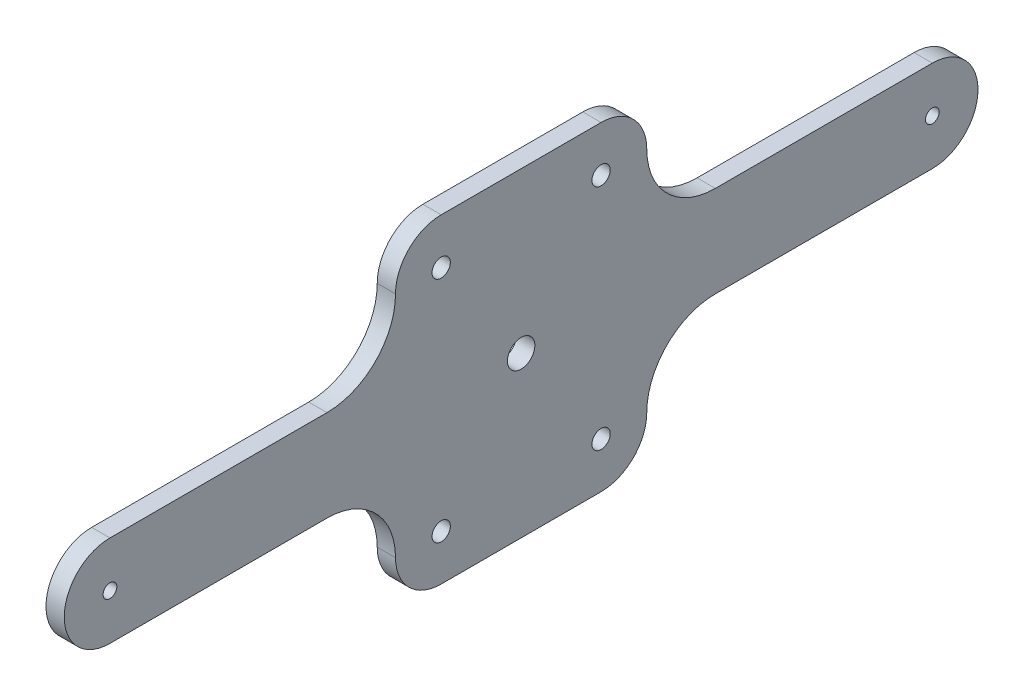
ISO-10303-21;
HEADER;
FILE_DESCRIPTION(('STEP AP214'),'2;1');
FILE_NAME('part.step','',(''),(''),'','','');
FILE_SCHEMA(('AUTOMOTIVE_DESIGN { 1 0 10303 214 1 1 1 1 }'));
ENDSEC;
DATA;
#1=APPLICATION_CONTEXT('core data for automotive mechanical design processes');
#2=APPLICATION_PROTOCOL_DEFINITION('international standard','automotive_design',2000,#1);
#3=PRODUCT_CONTEXT('',#1,'mechanical');
#4=PRODUCT('Part','Part','',(#3));
#5=PRODUCT_RELATED_PRODUCT_CATEGORY('part','',(#4));
#6=PRODUCT_DEFINITION_FORMATION('','',#4);
#7=PRODUCT_DEFINITION_CONTEXT('part definition',#1,'design');
#8=PRODUCT_DEFINITION('design','',#6,#7);
#9=PRODUCT_DEFINITION_SHAPE('','',#8);
#10=(LENGTH_UNIT() NAMED_UNIT(*) SI_UNIT(.MILLI.,.METRE.));
#11=(NAMED_UNIT(*) PLANE_ANGLE_UNIT() SI_UNIT($,.RADIAN.));
#12=(NAMED_UNIT(*) SI_UNIT($,.STERADIAN.) SOLID_ANGLE_UNIT());
#13=UNCERTAINTY_MEASURE_WITH_UNIT(LENGTH_MEASURE(1.E-05),#10,'distance_accuracy_value','');
#14=(GEOMETRIC_REPRESENTATION_CONTEXT(3) GLOBAL_UNCERTAINTY_ASSIGNED_CONTEXT((#13)) GLOBAL_UNIT_ASSIGNED_CONTEXT((#10,
#11,#12)) REPRESENTATION_CONTEXT('',''));
#15=CARTESIAN_POINT('',(0.,0.,0.));
#16=DIRECTION('',(0.,0.,1.));
#17=DIRECTION('',(1.,0.,0.));
#18=AXIS2_PLACEMENT_3D('',#15,#16,#17);
#19=CARTESIAN_POINT('',(4.,0.,0.));
#20=DIRECTION('',(1.,0.,0.));
#21=DIRECTION('',(0.,0.,-1.));
#22=AXIS2_PLACEMENT_3D('',#19,#20,#21);
#23=PLANE('',#22);
#24=CARTESIAN_POINT('',(4.,0.,0.));
#25=DIRECTION('',(1.,0.,0.));
#26=DIRECTION('',(0.,0.,-1.));
#27=AXIS2_PLACEMENT_3D('',#24,#25,#26);
#28=CIRCLE('',#27,3.);
#29=CARTESIAN_POINT('',(4.,0.,-3.));
#30=VERTEX_POINT('',#29);
#31=EDGE_CURVE('E188',#30,#30,#28,.T.);
#32=ORIENTED_EDGE('',*,*,#31,.F.);
#33=EDGE_LOOP('',(#32));
#34=FACE_BOUND('',#33,.T.);
#35=CARTESIAN_POINT('',(4.,25.,17.5));
#36=DIRECTION('',(1.,0.,0.));
#37=DIRECTION('',(0.,0.,-1.));
#38=AXIS2_PLACEMENT_3D('',#35,#36,#37);
#39=CIRCLE('',#38,2.);
#40=CARTESIAN_POINT('',(4.,25.,15.5));
#41=VERTEX_POINT('',#40);
#42=EDGE_CURVE('E305',#41,#41,#39,.T.);
#43=ORIENTED_EDGE('',*,*,#42,.F.);
#44=EDGE_LOOP('',(#43));
#45=FACE_BOUND('',#44,.T.);
#46=CARTESIAN_POINT('',(4.,0.,90.));
#47=DIRECTION('',(1.,0.,0.));
#48=DIRECTION('',(0.,0.,-1.));
#49=AXIS2_PLACEMENT_3D('',#46,#47,#48);
#50=CIRCLE('',#49,1.5);
#51=CARTESIAN_POINT('',(4.,0.,88.5));
#52=VERTEX_POINT('',#51);
#53=EDGE_CURVE('E41',#52,#52,#50,.T.);
#54=ORIENTED_EDGE('',*,*,#53,.F.);
#55=EDGE_LOOP('',(#54));
#56=FACE_BOUND('',#55,.T.);
#57=CARTESIAN_POINT('',(4.,-25.,17.5));
#58=DIRECTION('',(-1.,0.,0.));
#59=DIRECTION('',(0.,0.,-1.));
#60=AXIS2_PLACEMENT_3D('',#57,#58,#59);
#61=CIRCLE('',#60,2.);
#62=CARTESIAN_POINT('',(4.,-25.,15.5));
#63=VERTEX_POINT('',#62);
#64=EDGE_CURVE('E268',#63,#63,#61,.T.);
#65=ORIENTED_EDGE('',*,*,#64,.T.);
#66=EDGE_LOOP('',(#65));
#67=FACE_BOUND('',#66,.T.);
#68=CARTESIAN_POINT('',(4.,0.,-90.));
#69=DIRECTION('',(-1.,0.,0.));
#70=DIRECTION('',(0.,0.,1.));
#71=AXIS2_PLACEMENT_3D('',#68,#69,#70);
#72=CIRCLE('',#71,1.5);
#73=CARTESIAN_POINT('',(4.,0.,-88.5));
#74=VERTEX_POINT('',#73);
#75=EDGE_CURVE('E237',#74,#74,#72,.T.);
#76=ORIENTED_EDGE('',*,*,#75,.T.);
#77=EDGE_LOOP('',(#76));
#78=FACE_BOUND('',#77,.T.);
#79=CARTESIAN_POINT('',(4.,25.,-17.5));
#80=DIRECTION('',(-1.,0.,0.));
#81=DIRECTION('',(0.,0.,1.));
#82=AXIS2_PLACEMENT_3D('',#79,#80,#81);
#83=CIRCLE('',#82,2.);
#84=CARTESIAN_POINT('',(4.,25.,-15.5));
#85=VERTEX_POINT('',#84);
#86=EDGE_CURVE('E227',#85,#85,#83,.T.);
#87=ORIENTED_EDGE('',*,*,#86,.T.);
#88=EDGE_LOOP('',(#87));
#89=FACE_BOUND('',#88,.T.);
#90=CARTESIAN_POINT('',(4.,-25.,-17.5));
#91=DIRECTION('',(1.,0.,0.));
#92=DIRECTION('',(0.,0.,1.));
#93=AXIS2_PLACEMENT_3D('',#90,#91,#92);
#94=CIRCLE('',#93,2.);
#95=CARTESIAN_POINT('',(4.,-25.,-15.5));
#96=VERTEX_POINT('',#95);
#97=EDGE_CURVE('E200',#96,#96,#94,.T.);
#98=ORIENTED_EDGE('',*,*,#97,.F.);
#99=EDGE_LOOP('',(#98));
#100=FACE_BOUND('',#99,.T.);
#101=DIRECTION('',(0.,0.,-1.));
#102=VECTOR('',#101,1.);
#103=CARTESIAN_POINT('',(4.,-35.,17.5));
#104=LINE('',#103,#102);
#105=CARTESIAN_POINT('',(4.,-35.,17.5));
#106=VERTEX_POINT('',#105);
#107=CARTESIAN_POINT('',(4.,-35.,-17.5));
#108=VERTEX_POINT('',#107);
#109=EDGE_CURVE('E243',#106,#108,#104,.T.);
#110=ORIENTED_EDGE('',*,*,#109,.T.);
#111=CARTESIAN_POINT('',(4.,-25.,-17.5));
#112=DIRECTION('',(-1.,0.,0.));
#113=DIRECTION('',(0.,0.,1.));
#114=AXIS2_PLACEMENT_3D('',#111,#112,#113);
#115=CIRCLE('',#114,10.);
#116=CARTESIAN_POINT('',(4.,-25.,-27.5));
#117=VERTEX_POINT('',#116);
#118=EDGE_CURVE('E181',#117,#108,#115,.T.);
#119=ORIENTED_EDGE('',*,*,#118,.F.);
#120=CARTESIAN_POINT('',(4.,-25.,-42.5));
#121=DIRECTION('',(1.,0.,0.));
#122=DIRECTION('',(0.,0.,1.));
#123=AXIS2_PLACEMENT_3D('',#120,#121,#122);
#124=CIRCLE('',#123,15.);
#125=CARTESIAN_POINT('',(4.,-10.,-42.5));
#126=VERTEX_POINT('',#125);
#127=EDGE_CURVE('E185',#126,#117,#124,.T.);
#128=ORIENTED_EDGE('',*,*,#127,.F.);
#129=DIRECTION('',(0.,0.,1.));
#130=VECTOR('',#129,1.);
#131=CARTESIAN_POINT('',(4.,-10.,-90.));
#132=LINE('',#131,#130);
#133=CARTESIAN_POINT('',(4.,-10.,-90.));
#134=VERTEX_POINT('',#133);
#135=EDGE_CURVE('E192',#134,#126,#132,.T.);
#136=ORIENTED_EDGE('',*,*,#135,.F.);
#137=CARTESIAN_POINT('',(4.,0.,-90.));
#138=DIRECTION('',(1.,0.,0.));
#139=DIRECTION('',(0.,0.,1.));
#140=AXIS2_PLACEMENT_3D('',#137,#138,#139);
#141=CIRCLE('',#140,10.);
#142=CARTESIAN_POINT('',(4.,10.,-90.));
#143=VERTEX_POINT('',#142);
#144=EDGE_CURVE('E171',#134,#143,#141,.T.);
#145=ORIENTED_EDGE('',*,*,#144,.T.);
#146=DIRECTION('',(0.,0.,1.));
#147=VECTOR('',#146,1.);
#148=CARTESIAN_POINT('',(4.,10.,-90.));
#149=LINE('',#148,#147);
#150=CARTESIAN_POINT('',(4.,10.,-42.5));
#151=VERTEX_POINT('',#150);
#152=EDGE_CURVE('E221',#143,#151,#149,.T.);
#153=ORIENTED_EDGE('',*,*,#152,.T.);
#154=CARTESIAN_POINT('',(4.,25.,-42.5));
#155=DIRECTION('',(-1.,0.,0.));
#156=DIRECTION('',(0.,0.,1.));
#157=AXIS2_PLACEMENT_3D('',#154,#155,#156);
#158=CIRCLE('',#157,15.);
#159=CARTESIAN_POINT('',(4.,25.,-27.5));
#160=VERTEX_POINT('',#159);
#161=EDGE_CURVE('E218',#151,#160,#158,.T.);
#162=ORIENTED_EDGE('',*,*,#161,.T.);
#163=CARTESIAN_POINT('',(4.,25.,-17.5));
#164=DIRECTION('',(1.,0.,0.));
#165=DIRECTION('',(0.,0.,1.));
#166=AXIS2_PLACEMENT_3D('',#163,#164,#165);
#167=CIRCLE('',#166,10.);
#168=CARTESIAN_POINT('',(4.,35.,-17.5));
#169=VERTEX_POINT('',#168);
#170=EDGE_CURVE('E207',#160,#169,#167,.T.);
#171=ORIENTED_EDGE('',*,*,#170,.T.);
#172=DIRECTION('',(0.,0.,-1.));
#173=VECTOR('',#172,1.);
#174=CARTESIAN_POINT('',(4.,35.,17.5));
#175=LINE('',#174,#173);
#176=CARTESIAN_POINT('',(4.,35.,17.5));
#177=VERTEX_POINT('',#176);
#178=EDGE_CURVE('E283',#177,#169,#175,.T.);
#179=ORIENTED_EDGE('',*,*,#178,.F.);
#180=CARTESIAN_POINT('',(4.,25.,17.5));
#181=DIRECTION('',(-1.,0.,0.));
#182=DIRECTION('',(0.,0.,-1.));
#183=AXIS2_PLACEMENT_3D('',#180,#181,#182);
#184=CIRCLE('',#183,10.);
#185=CARTESIAN_POINT('',(4.,25.,27.5));
#186=VERTEX_POINT('',#185);
#187=EDGE_CURVE('E301',#186,#177,#184,.T.);
#188=ORIENTED_EDGE('',*,*,#187,.F.);
#189=CARTESIAN_POINT('',(4.,25.,42.5));
#190=DIRECTION('',(1.,0.,0.));
#191=DIRECTION('',(0.,0.,-1.));
#192=AXIS2_PLACEMENT_3D('',#189,#190,#191);
#193=CIRCLE('',#192,15.);
#194=CARTESIAN_POINT('',(4.,10.,42.5));
#195=VERTEX_POINT('',#194);
#196=EDGE_CURVE('E298',#195,#186,#193,.T.);
#197=ORIENTED_EDGE('',*,*,#196,.F.);
#198=DIRECTION('',(0.,0.,-1.));
#199=VECTOR('',#198,1.);
#200=CARTESIAN_POINT('',(4.,10.,90.));
#201=LINE('',#200,#199);
#202=CARTESIAN_POINT('',(4.,10.,90.));
#203=VERTEX_POINT('',#202);
#204=EDGE_CURVE('E296',#203,#195,#201,.T.);
#205=ORIENTED_EDGE('',*,*,#204,.F.);
#206=CARTESIAN_POINT('',(4.,0.,90.));
#207=DIRECTION('',(-1.,0.,0.));
#208=DIRECTION('',(0.,0.,-1.));
#209=AXIS2_PLACEMENT_3D('',#206,#207,#208);
#210=CIRCLE('',#209,10.);
#211=CARTESIAN_POINT('',(4.,-10.,90.));
#212=VERTEX_POINT('',#211);
#213=EDGE_CURVE('E277',#212,#203,#210,.T.);
#214=ORIENTED_EDGE('',*,*,#213,.F.);
#215=DIRECTION('',(0.,0.,-1.));
#216=VECTOR('',#215,1.);
#217=CARTESIAN_POINT('',(4.,-10.,90.));
#218=LINE('',#217,#216);
#219=CARTESIAN_POINT('',(4.,-10.,42.5));
#220=VERTEX_POINT('',#219);
#221=EDGE_CURVE('E249',#212,#220,#218,.T.);
#222=ORIENTED_EDGE('',*,*,#221,.T.);
#223=CARTESIAN_POINT('',(4.,-25.,42.5));
#224=DIRECTION('',(-1.,0.,0.));
#225=DIRECTION('',(0.,0.,-1.));
#226=AXIS2_PLACEMENT_3D('',#223,#224,#225);
#227=CIRCLE('',#226,15.);
#228=CARTESIAN_POINT('',(4.,-25.,27.5));
#229=VERTEX_POINT('',#228);
#230=EDGE_CURVE('E260',#220,#229,#227,.T.);
#231=ORIENTED_EDGE('',*,*,#230,.T.);
#232=CARTESIAN_POINT('',(4.,-25.,17.5));
#233=DIRECTION('',(1.,0.,0.));
#234=DIRECTION('',(0.,0.,-1.));
#235=AXIS2_PLACEMENT_3D('',#232,#233,#234);
#236=CIRCLE('',#235,10.);
#237=EDGE_CURVE('E257',#229,#106,#236,.T.);
#238=ORIENTED_EDGE('',*,*,#237,.T.);
#239=EDGE_LOOP('',(#110,#119,#128,#136,#145,#153,#162,#171,#179,#188,#197,#205,#214,#222,#231,#238));
#240=FACE_BOUND('',#239,.T.);
#241=ADVANCED_FACE('F37',(#34,#45,#56,#67,#78,#89,#100,#240),#23,.T.);
#242=CARTESIAN_POINT('',(0.,0.,0.));
#243=DIRECTION('',(1.,0.,0.));
#244=DIRECTION('',(0.,0.,-1.));
#245=AXIS2_PLACEMENT_3D('',#242,#243,#244);
#246=PLANE('',#245);
#247=CARTESIAN_POINT('',(0.,0.,0.));
#248=DIRECTION('',(1.,0.,0.));
#249=DIRECTION('',(0.,0.,-1.));
#250=AXIS2_PLACEMENT_3D('',#247,#248,#249);
#251=CIRCLE('',#250,3.);
#252=CARTESIAN_POINT('',(0.,0.,-3.));
#253=VERTEX_POINT('',#252);
#254=EDGE_CURVE('E194',#253,#253,#251,.T.);
#255=ORIENTED_EDGE('',*,*,#254,.T.);
#256=EDGE_LOOP('',(#255));
#257=FACE_BOUND('',#256,.T.);
#258=CARTESIAN_POINT('',(0.,-25.,-17.5));
#259=DIRECTION('',(1.,0.,0.));
#260=DIRECTION('',(0.,0.,1.));
#261=AXIS2_PLACEMENT_3D('',#258,#259,#260);
#262=CIRCLE('',#261,2.);
#263=CARTESIAN_POINT('',(0.,-25.,-15.5));
#264=VERTEX_POINT('',#263);
#265=EDGE_CURVE('E204',#264,#264,#262,.T.);
#266=ORIENTED_EDGE('',*,*,#265,.T.);
#267=EDGE_LOOP('',(#266));
#268=FACE_BOUND('',#267,.T.);
#269=CARTESIAN_POINT('',(0.,-25.,17.5));
#270=DIRECTION('',(-1.,0.,0.));
#271=DIRECTION('',(0.,0.,-1.));
#272=AXIS2_PLACEMENT_3D('',#269,#270,#271);
#273=CIRCLE('',#272,2.);
#274=CARTESIAN_POINT('',(0.,-25.,15.5));
#275=VERTEX_POINT('',#274);
#276=EDGE_CURVE('E274',#275,#275,#273,.T.);
#277=ORIENTED_EDGE('',*,*,#276,.F.);
#278=EDGE_LOOP('',(#277));
#279=FACE_BOUND('',#278,.T.);
#280=CARTESIAN_POINT('',(0.,25.,17.5));
#281=DIRECTION('',(1.,0.,0.));
#282=DIRECTION('',(0.,0.,-1.));
#283=AXIS2_PLACEMENT_3D('',#280,#281,#282);
#284=CIRCLE('',#283,2.);
#285=CARTESIAN_POINT('',(0.,25.,15.5));
#286=VERTEX_POINT('',#285);
#287=EDGE_CURVE('E310',#286,#286,#284,.T.);
#288=ORIENTED_EDGE('',*,*,#287,.T.);
#289=EDGE_LOOP('',(#288));
#290=FACE_BOUND('',#289,.T.);
#291=CARTESIAN_POINT('',(0.,0.,90.));
#292=DIRECTION('',(1.,0.,0.));
#293=DIRECTION('',(0.,0.,-1.));
#294=AXIS2_PLACEMENT_3D('',#291,#292,#293);
#295=CIRCLE('',#294,1.5);
#296=CARTESIAN_POINT('',(0.,0.,88.5));
#297=VERTEX_POINT('',#296);
#298=EDGE_CURVE('E11',#297,#297,#295,.T.);
#299=ORIENTED_EDGE('',*,*,#298,.T.);
#300=EDGE_LOOP('',(#299));
#301=FACE_BOUND('',#300,.T.);
#302=CARTESIAN_POINT('',(0.,0.,-90.));
#303=DIRECTION('',(-1.,0.,0.));
#304=DIRECTION('',(0.,0.,1.));
#305=AXIS2_PLACEMENT_3D('',#302,#303,#304);
#306=CIRCLE('',#305,1.5);
#307=CARTESIAN_POINT('',(0.,0.,-88.5));
#308=VERTEX_POINT('',#307);
#309=EDGE_CURVE('E240',#308,#308,#306,.T.);
#310=ORIENTED_EDGE('',*,*,#309,.F.);
#311=EDGE_LOOP('',(#310));
#312=FACE_BOUND('',#311,.T.);
#313=CARTESIAN_POINT('',(0.,25.,-17.5));
#314=DIRECTION('',(-1.,0.,0.));
#315=DIRECTION('',(0.,0.,1.));
#316=AXIS2_PLACEMENT_3D('',#313,#314,#315);
#317=CIRCLE('',#316,2.);
#318=CARTESIAN_POINT('',(0.,25.,-15.5));
#319=VERTEX_POINT('',#318);
#320=EDGE_CURVE('E234',#319,#319,#317,.T.);
#321=ORIENTED_EDGE('',*,*,#320,.F.);
#322=EDGE_LOOP('',(#321));
#323=FACE_BOUND('',#322,.T.);
#324=CARTESIAN_POINT('',(0.,-25.,-17.5));
#325=DIRECTION('',(-1.,0.,0.));
#326=DIRECTION('',(0.,0.,1.));
#327=AXIS2_PLACEMENT_3D('',#324,#325,#326);
#328=CIRCLE('',#327,10.);
#329=CARTESIAN_POINT('',(0.,-25.,-27.5));
#330=VERTEX_POINT('',#329);
#331=CARTESIAN_POINT('',(0.,-35.,-17.5));
#332=VERTEX_POINT('',#331);
#333=EDGE_CURVE('E176',#330,#332,#328,.T.);
#334=ORIENTED_EDGE('',*,*,#333,.T.);
#335=DIRECTION('',(0.,0.,-1.));
#336=VECTOR('',#335,1.);
#337=CARTESIAN_POINT('',(0.,-35.,17.5));
#338=LINE('',#337,#336);
#339=CARTESIAN_POINT('',(0.,-35.,17.5));
#340=VERTEX_POINT('',#339);
#341=EDGE_CURVE('E246',#340,#332,#338,.T.);
#342=ORIENTED_EDGE('',*,*,#341,.F.);
#343=CARTESIAN_POINT('',(0.,-25.,17.5));
#344=DIRECTION('',(1.,0.,0.));
#345=DIRECTION('',(0.,0.,-1.));
#346=AXIS2_PLACEMENT_3D('',#343,#344,#345);
#347=CIRCLE('',#346,10.);
#348=CARTESIAN_POINT('',(0.,-25.,27.5));
#349=VERTEX_POINT('',#348);
#350=EDGE_CURVE('E248',#349,#340,#347,.T.);
#351=ORIENTED_EDGE('',*,*,#350,.F.);
#352=CARTESIAN_POINT('',(0.,-25.,42.5));
#353=DIRECTION('',(-1.,0.,0.));
#354=DIRECTION('',(0.,0.,-1.));
#355=AXIS2_PLACEMENT_3D('',#352,#353,#354);
#356=CIRCLE('',#355,15.);
#357=CARTESIAN_POINT('',(0.,-10.,42.5));
#358=VERTEX_POINT('',#357);
#359=EDGE_CURVE('E251',#358,#349,#356,.T.);
#360=ORIENTED_EDGE('',*,*,#359,.F.);
#361=DIRECTION('',(0.,0.,-1.));
#362=VECTOR('',#361,1.);
#363=CARTESIAN_POINT('',(0.,-10.,90.));
#364=LINE('',#363,#362);
#365=CARTESIAN_POINT('',(0.,-10.,90.));
#366=VERTEX_POINT('',#365);
#367=EDGE_CURVE('E253',#366,#358,#364,.T.);
#368=ORIENTED_EDGE('',*,*,#367,.F.);
#369=CARTESIAN_POINT('',(0.,0.,90.));
#370=DIRECTION('',(-1.,0.,0.));
#371=DIRECTION('',(0.,0.,-1.));
#372=AXIS2_PLACEMENT_3D('',#369,#370,#371);
#373=CIRCLE('',#372,10.);
#374=CARTESIAN_POINT('',(0.,10.,90.));
#375=VERTEX_POINT('',#374);
#376=EDGE_CURVE('E280',#366,#375,#373,.T.);
#377=ORIENTED_EDGE('',*,*,#376,.T.);
#378=DIRECTION('',(0.,0.,-1.));
#379=VECTOR('',#378,1.);
#380=CARTESIAN_POINT('',(0.,10.,90.));
#381=LINE('',#380,#379);
#382=CARTESIAN_POINT('',(0.,10.,42.5));
#383=VERTEX_POINT('',#382);
#384=EDGE_CURVE('E52',#375,#383,#381,.T.);
#385=ORIENTED_EDGE('',*,*,#384,.T.);
#386=CARTESIAN_POINT('',(0.,25.,42.5));
#387=DIRECTION('',(1.,0.,0.));
#388=DIRECTION('',(0.,0.,-1.));
#389=AXIS2_PLACEMENT_3D('',#386,#387,#388);
#390=CIRCLE('',#389,15.);
#391=CARTESIAN_POINT('',(0.,25.,27.5));
#392=VERTEX_POINT('',#391);
#393=EDGE_CURVE('E285',#383,#392,#390,.T.);
#394=ORIENTED_EDGE('',*,*,#393,.T.);
#395=CARTESIAN_POINT('',(0.,25.,17.5));
#396=DIRECTION('',(-1.,0.,0.));
#397=DIRECTION('',(0.,0.,-1.));
#398=AXIS2_PLACEMENT_3D('',#395,#396,#397);
#399=CIRCLE('',#398,10.);
#400=CARTESIAN_POINT('',(0.,35.,17.5));
#401=VERTEX_POINT('',#400);
#402=EDGE_CURVE('E288',#392,#401,#399,.T.);
#403=ORIENTED_EDGE('',*,*,#402,.T.);
#404=DIRECTION('',(0.,0.,-1.));
#405=VECTOR('',#404,1.);
#406=CARTESIAN_POINT('',(0.,35.,17.5));
#407=LINE('',#406,#405);
#408=CARTESIAN_POINT('',(0.,35.,-17.5));
#409=VERTEX_POINT('',#408);
#410=EDGE_CURVE('E291',#401,#409,#407,.T.);
#411=ORIENTED_EDGE('',*,*,#410,.T.);
#412=CARTESIAN_POINT('',(0.,25.,-17.5));
#413=DIRECTION('',(1.,0.,0.));
#414=DIRECTION('',(0.,0.,1.));
#415=AXIS2_PLACEMENT_3D('',#412,#413,#414);
#416=CIRCLE('',#415,10.);
#417=CARTESIAN_POINT('',(0.,25.,-27.5));
#418=VERTEX_POINT('',#417);
#419=EDGE_CURVE('E210',#418,#409,#416,.T.);
#420=ORIENTED_EDGE('',*,*,#419,.F.);
#421=CARTESIAN_POINT('',(0.,25.,-42.5));
#422=DIRECTION('',(-1.,0.,0.));
#423=DIRECTION('',(0.,0.,1.));
#424=AXIS2_PLACEMENT_3D('',#421,#422,#423);
#425=CIRCLE('',#424,15.);
#426=CARTESIAN_POINT('',(0.,10.,-42.5));
#427=VERTEX_POINT('',#426);
#428=EDGE_CURVE('E213',#427,#418,#425,.T.);
#429=ORIENTED_EDGE('',*,*,#428,.F.);
#430=DIRECTION('',(0.,0.,1.));
#431=VECTOR('',#430,1.);
#432=CARTESIAN_POINT('',(0.,10.,-90.));
#433=LINE('',#432,#431);
#434=CARTESIAN_POINT('',(0.,10.,-90.));
#435=VERTEX_POINT('',#434);
#436=EDGE_CURVE('E162',#435,#427,#433,.T.);
#437=ORIENTED_EDGE('',*,*,#436,.F.);
#438=CARTESIAN_POINT('',(0.,0.,-90.));
#439=DIRECTION('',(1.,0.,0.));
#440=DIRECTION('',(0.,0.,1.));
#441=AXIS2_PLACEMENT_3D('',#438,#439,#440);
#442=CIRCLE('',#441,10.);
#443=CARTESIAN_POINT('',(0.,-10.,-90.));
#444=VERTEX_POINT('',#443);
#445=EDGE_CURVE('E155',#444,#435,#442,.T.);
#446=ORIENTED_EDGE('',*,*,#445,.F.);
#447=DIRECTION('',(0.,0.,1.));
#448=VECTOR('',#447,1.);
#449=CARTESIAN_POINT('',(0.,-10.,-90.));
#450=LINE('',#449,#448);
#451=CARTESIAN_POINT('',(0.,-10.,-42.5));
#452=VERTEX_POINT('',#451);
#453=EDGE_CURVE('E160',#444,#452,#450,.T.);
#454=ORIENTED_EDGE('',*,*,#453,.T.);
#455=CARTESIAN_POINT('',(0.,-25.,-42.5));
#456=DIRECTION('',(1.,0.,0.));
#457=DIRECTION('',(0.,0.,1.));
#458=AXIS2_PLACEMENT_3D('',#455,#456,#457);
#459=CIRCLE('',#458,15.);
#460=EDGE_CURVE('E180',#452,#330,#459,.T.);
#461=ORIENTED_EDGE('',*,*,#460,.T.);
#462=EDGE_LOOP('',(#334,#342,#351,#360,#368,#377,#385,#394,#403,#411,#420,#429,#437,#446,#454,#461));
#463=FACE_BOUND('',#462,.T.);
#464=ADVANCED_FACE('F39',(#257,#268,#279,#290,#301,#312,#323,#463),#246,.F.);
#465=CARTESIAN_POINT('',(0.,0.,90.));
#466=DIRECTION('',(1.,0.,0.));
#467=DIRECTION('',(0.,0.,-1.));
#468=AXIS2_PLACEMENT_3D('',#465,#466,#467);
#469=CYLINDRICAL_SURFACE('',#468,1.5);
#470=ORIENTED_EDGE('',*,*,#298,.F.);
#471=EDGE_LOOP('',(#470));
#472=FACE_BOUND('',#471,.T.);
#473=ORIENTED_EDGE('',*,*,#53,.T.);
#474=EDGE_LOOP('',(#473));
#475=FACE_BOUND('',#474,.T.);
#476=ADVANCED_FACE('F411',(#472,#475),#469,.F.);
#477=CARTESIAN_POINT('',(0.,25.,17.5));
#478=DIRECTION('',(1.,0.,0.));
#479=DIRECTION('',(0.,0.,-1.));
#480=AXIS2_PLACEMENT_3D('',#477,#478,#479);
#481=CYLINDRICAL_SURFACE('',#480,2.);
#482=ORIENTED_EDGE('',*,*,#287,.F.);
#483=EDGE_LOOP('',(#482));
#484=FACE_BOUND('',#483,.T.);
#485=ORIENTED_EDGE('',*,*,#42,.T.);
#486=EDGE_LOOP('',(#485));
#487=FACE_BOUND('',#486,.T.);
#488=ADVANCED_FACE('F316',(#484,#487),#481,.F.);
#489=CARTESIAN_POINT('',(0.,35.,17.5));
#490=DIRECTION('',(0.,-1.,0.));
#491=DIRECTION('',(0.,0.,-1.));
#492=AXIS2_PLACEMENT_3D('',#489,#490,#491);
#493=PLANE('',#492);
#494=ORIENTED_EDGE('',*,*,#178,.T.);
#495=DIRECTION('',(1.,0.,0.));
#496=VECTOR('',#495,1.);
#497=CARTESIAN_POINT('',(0.,35.,-17.5));
#498=LINE('',#497,#496);
#499=EDGE_CURVE('E165',#409,#169,#498,.T.);
#500=ORIENTED_EDGE('',*,*,#499,.F.);
#501=ORIENTED_EDGE('',*,*,#410,.F.);
#502=DIRECTION('',(1.,0.,0.));
#503=VECTOR('',#502,1.);
#504=CARTESIAN_POINT('',(0.,35.,17.5));
#505=LINE('',#504,#503);
#506=EDGE_CURVE('E61',#401,#177,#505,.T.);
#507=ORIENTED_EDGE('',*,*,#506,.T.);
#508=EDGE_LOOP('',(#494,#500,#501,#507));
#509=FACE_BOUND('',#508,.T.);
#510=ADVANCED_FACE('F362',(#509),#493,.F.);
#511=CARTESIAN_POINT('',(0.,25.,17.5));
#512=DIRECTION('',(1.,0.,0.));
#513=DIRECTION('',(0.,0.,-1.));
#514=AXIS2_PLACEMENT_3D('',#511,#512,#513);
#515=CYLINDRICAL_SURFACE('',#514,10.);
#516=ORIENTED_EDGE('',*,*,#187,.T.);
#517=ORIENTED_EDGE('',*,*,#506,.F.);
#518=ORIENTED_EDGE('',*,*,#402,.F.);
#519=DIRECTION('',(1.,0.,0.));
#520=VECTOR('',#519,1.);
#521=CARTESIAN_POINT('',(0.,25.,27.5));
#522=LINE('',#521,#520);
#523=EDGE_CURVE('E306',#392,#186,#522,.T.);
#524=ORIENTED_EDGE('',*,*,#523,.T.);
#525=EDGE_LOOP('',(#516,#517,#518,#524));
#526=FACE_BOUND('',#525,.T.);
#527=ADVANCED_FACE('F363',(#526),#515,.T.);
#528=CARTESIAN_POINT('',(0.,25.,42.5));
#529=DIRECTION('',(1.,0.,0.));
#530=DIRECTION('',(0.,0.,-1.));
#531=AXIS2_PLACEMENT_3D('',#528,#529,#530);
#532=CYLINDRICAL_SURFACE('',#531,15.);
#533=ORIENTED_EDGE('',*,*,#196,.T.);
#534=ORIENTED_EDGE('',*,*,#523,.F.);
#535=ORIENTED_EDGE('',*,*,#393,.F.);
#536=DIRECTION('',(1.,0.,0.));
#537=VECTOR('',#536,1.);
#538=CARTESIAN_POINT('',(0.,10.,42.5));
#539=LINE('',#538,#537);
#540=EDGE_CURVE('E80',#383,#195,#539,.T.);
#541=ORIENTED_EDGE('',*,*,#540,.T.);
#542=EDGE_LOOP('',(#533,#534,#535,#541));
#543=FACE_BOUND('',#542,.T.);
#544=ADVANCED_FACE('F365',(#543),#532,.F.);
#545=CARTESIAN_POINT('',(0.,10.,90.));
#546=DIRECTION('',(0.,-1.,0.));
#547=DIRECTION('',(0.,0.,-1.));
#548=AXIS2_PLACEMENT_3D('',#545,#546,#547);
#549=PLANE('',#548);
#550=ORIENTED_EDGE('',*,*,#204,.T.);
#551=ORIENTED_EDGE('',*,*,#540,.F.);
#552=ORIENTED_EDGE('',*,*,#384,.F.);
#553=DIRECTION('',(1.,0.,0.));
#554=VECTOR('',#553,1.);
#555=CARTESIAN_POINT('',(0.,10.,90.));
#556=LINE('',#555,#554);
#557=EDGE_CURVE('E293',#375,#203,#556,.T.);
#558=ORIENTED_EDGE('',*,*,#557,.T.);
#559=EDGE_LOOP('',(#550,#551,#552,#558));
#560=FACE_BOUND('',#559,.T.);
#561=ADVANCED_FACE('F367',(#560),#549,.F.);
#562=CARTESIAN_POINT('',(0.,0.,90.));
#563=DIRECTION('',(1.,0.,0.));
#564=DIRECTION('',(0.,0.,-1.));
#565=AXIS2_PLACEMENT_3D('',#562,#563,#564);
#566=CYLINDRICAL_SURFACE('',#565,10.);
#567=ORIENTED_EDGE('',*,*,#213,.T.);
#568=ORIENTED_EDGE('',*,*,#557,.F.);
#569=ORIENTED_EDGE('',*,*,#376,.F.);
#570=DIRECTION('',(1.,0.,0.));
#571=VECTOR('',#570,1.);
#572=CARTESIAN_POINT('',(0.,-10.,90.));
#573=LINE('',#572,#571);
#574=EDGE_CURVE('E265',#366,#212,#573,.T.);
#575=ORIENTED_EDGE('',*,*,#574,.T.);
#576=EDGE_LOOP('',(#567,#568,#569,#575));
#577=FACE_BOUND('',#576,.T.);
#578=ADVANCED_FACE('F369',(#577),#566,.T.);
#579=CARTESIAN_POINT('',(0.,-25.,17.5));
#580=DIRECTION('',(1.,0.,0.));
#581=DIRECTION('',(0.,0.,-1.));
#582=AXIS2_PLACEMENT_3D('',#579,#580,#581);
#583=CYLINDRICAL_SURFACE('',#582,2.);
#584=ORIENTED_EDGE('',*,*,#276,.T.);
#585=EDGE_LOOP('',(#584));
#586=FACE_BOUND('',#585,.T.);
#587=ORIENTED_EDGE('',*,*,#64,.F.);
#588=EDGE_LOOP('',(#587));
#589=FACE_BOUND('',#588,.T.);
#590=ADVANCED_FACE('F395',(#586,#589),#583,.F.);
#591=CARTESIAN_POINT('',(0.,-10.,90.));
#592=DIRECTION('',(0.,-1.,0.));
#593=DIRECTION('',(0.,0.,-1.));
#594=AXIS2_PLACEMENT_3D('',#591,#592,#593);
#595=PLANE('',#594);
#596=ORIENTED_EDGE('',*,*,#221,.F.);
#597=ORIENTED_EDGE('',*,*,#574,.F.);
#598=ORIENTED_EDGE('',*,*,#367,.T.);
#599=DIRECTION('',(1.,0.,0.));
#600=VECTOR('',#599,1.);
#601=CARTESIAN_POINT('',(0.,-10.,42.5));
#602=LINE('',#601,#600);
#603=EDGE_CURVE('E269',#358,#220,#602,.T.);
#604=ORIENTED_EDGE('',*,*,#603,.T.);
#605=EDGE_LOOP('',(#596,#597,#598,#604));
#606=FACE_BOUND('',#605,.T.);
#607=ADVANCED_FACE('F374',(#606),#595,.T.);
#608=CARTESIAN_POINT('',(0.,-25.,42.5));
#609=DIRECTION('',(1.,0.,0.));
#610=DIRECTION('',(0.,0.,-1.));
#611=AXIS2_PLACEMENT_3D('',#608,#609,#610);
#612=CYLINDRICAL_SURFACE('',#611,15.);
#613=ORIENTED_EDGE('',*,*,#230,.F.);
#614=ORIENTED_EDGE('',*,*,#603,.F.);
#615=ORIENTED_EDGE('',*,*,#359,.T.);
#616=DIRECTION('',(1.,0.,0.));
#617=VECTOR('',#616,1.);
#618=CARTESIAN_POINT('',(0.,-25.,27.5));
#619=LINE('',#618,#617);
#620=EDGE_CURVE('E271',#349,#229,#619,.T.);
#621=ORIENTED_EDGE('',*,*,#620,.T.);
#622=EDGE_LOOP('',(#613,#614,#615,#621));
#623=FACE_BOUND('',#622,.T.);
#624=ADVANCED_FACE('F378',(#623),#612,.F.);
#625=CARTESIAN_POINT('',(0.,-25.,17.5));
#626=DIRECTION('',(1.,0.,0.));
#627=DIRECTION('',(0.,0.,-1.));
#628=AXIS2_PLACEMENT_3D('',#625,#626,#627);
#629=CYLINDRICAL_SURFACE('',#628,10.);
#630=ORIENTED_EDGE('',*,*,#237,.F.);
#631=ORIENTED_EDGE('',*,*,#620,.F.);
#632=ORIENTED_EDGE('',*,*,#350,.T.);
#633=DIRECTION('',(1.,0.,0.));
#634=VECTOR('',#633,1.);
#635=CARTESIAN_POINT('',(0.,-35.,17.5));
#636=LINE('',#635,#634);
#637=EDGE_CURVE('E255',#340,#106,#636,.T.);
#638=ORIENTED_EDGE('',*,*,#637,.T.);
#639=EDGE_LOOP('',(#630,#631,#632,#638));
#640=FACE_BOUND('',#639,.T.);
#641=ADVANCED_FACE('F383',(#640),#629,.T.);
#642=CARTESIAN_POINT('',(0.,-35.,17.5));
#643=DIRECTION('',(0.,-1.,0.));
#644=DIRECTION('',(0.,0.,-1.));
#645=AXIS2_PLACEMENT_3D('',#642,#643,#644);
#646=PLANE('',#645);
#647=ORIENTED_EDGE('',*,*,#109,.F.);
#648=ORIENTED_EDGE('',*,*,#637,.F.);
#649=ORIENTED_EDGE('',*,*,#341,.T.);
#650=DIRECTION('',(1.,0.,0.));
#651=VECTOR('',#650,1.);
#652=CARTESIAN_POINT('',(0.,-35.,-17.5));
#653=LINE('',#652,#651);
#654=EDGE_CURVE('E197',#332,#108,#653,.T.);
#655=ORIENTED_EDGE('',*,*,#654,.T.);
#656=EDGE_LOOP('',(#647,#648,#649,#655));
#657=FACE_BOUND('',#656,.T.);
#658=ADVANCED_FACE('F339',(#657),#646,.T.);
#659=CARTESIAN_POINT('',(0.,0.,-90.));
#660=DIRECTION('',(1.,0.,0.));
#661=DIRECTION('',(0.,0.,-1.));
#662=AXIS2_PLACEMENT_3D('',#659,#660,#661);
#663=CYLINDRICAL_SURFACE('',#662,1.5);
#664=ORIENTED_EDGE('',*,*,#309,.T.);
#665=EDGE_LOOP('',(#664));
#666=FACE_BOUND('',#665,.T.);
#667=ORIENTED_EDGE('',*,*,#75,.F.);
#668=EDGE_LOOP('',(#667));
#669=FACE_BOUND('',#668,.T.);
#670=ADVANCED_FACE('F390',(#666,#669),#663,.F.);
#671=CARTESIAN_POINT('',(0.,25.,-17.5));
#672=DIRECTION('',(1.,0.,0.));
#673=DIRECTION('',(0.,0.,-1.));
#674=AXIS2_PLACEMENT_3D('',#671,#672,#673);
#675=CYLINDRICAL_SURFACE('',#674,2.);
#676=ORIENTED_EDGE('',*,*,#320,.T.);
#677=EDGE_LOOP('',(#676));
#678=FACE_BOUND('',#677,.T.);
#679=ORIENTED_EDGE('',*,*,#86,.F.);
#680=EDGE_LOOP('',(#679));
#681=FACE_BOUND('',#680,.T.);
#682=ADVANCED_FACE('F427',(#678,#681),#675,.F.);
#683=CARTESIAN_POINT('',(0.,0.,-90.));
#684=DIRECTION('',(1.,0.,0.));
#685=DIRECTION('',(0.,0.,-1.));
#686=AXIS2_PLACEMENT_3D('',#683,#684,#685);
#687=CYLINDRICAL_SURFACE('',#686,10.);
#688=ORIENTED_EDGE('',*,*,#144,.F.);
#689=DIRECTION('',(1.,0.,0.));
#690=VECTOR('',#689,1.);
#691=CARTESIAN_POINT('',(0.,-10.,-90.));
#692=LINE('',#691,#690);
#693=EDGE_CURVE('E168',#444,#134,#692,.T.);
#694=ORIENTED_EDGE('',*,*,#693,.F.);
#695=ORIENTED_EDGE('',*,*,#445,.T.);
#696=DIRECTION('',(1.,0.,0.));
#697=VECTOR('',#696,1.);
#698=CARTESIAN_POINT('',(0.,10.,-90.));
#699=LINE('',#698,#697);
#700=EDGE_CURVE('E225',#435,#143,#699,.T.);
#701=ORIENTED_EDGE('',*,*,#700,.T.);
#702=EDGE_LOOP('',(#688,#694,#695,#701));
#703=FACE_BOUND('',#702,.T.);
#704=ADVANCED_FACE('F169',(#703),#687,.T.);
#705=CARTESIAN_POINT('',(0.,10.,-90.));
#706=DIRECTION('',(0.,1.,0.));
#707=DIRECTION('',(0.,0.,1.));
#708=AXIS2_PLACEMENT_3D('',#705,#706,#707);
#709=PLANE('',#708);
#710=ORIENTED_EDGE('',*,*,#152,.F.);
#711=ORIENTED_EDGE('',*,*,#700,.F.);
#712=ORIENTED_EDGE('',*,*,#436,.T.);
#713=DIRECTION('',(1.,0.,0.));
#714=VECTOR('',#713,1.);
#715=CARTESIAN_POINT('',(0.,10.,-42.5));
#716=LINE('',#715,#714);
#717=EDGE_CURVE('E228',#427,#151,#716,.T.);
#718=ORIENTED_EDGE('',*,*,#717,.T.);
#719=EDGE_LOOP('',(#710,#711,#712,#718));
#720=FACE_BOUND('',#719,.T.);
#721=ADVANCED_FACE('F349',(#720),#709,.T.);
#722=CARTESIAN_POINT('',(0.,25.,-42.5));
#723=DIRECTION('',(1.,0.,0.));
#724=DIRECTION('',(0.,0.,-1.));
#725=AXIS2_PLACEMENT_3D('',#722,#723,#724);
#726=CYLINDRICAL_SURFACE('',#725,15.);
#727=ORIENTED_EDGE('',*,*,#161,.F.);
#728=ORIENTED_EDGE('',*,*,#717,.F.);
#729=ORIENTED_EDGE('',*,*,#428,.T.);
#730=DIRECTION('',(1.,0.,0.));
#731=VECTOR('',#730,1.);
#732=CARTESIAN_POINT('',(0.,25.,-27.5));
#733=LINE('',#732,#731);
#734=EDGE_CURVE('E230',#418,#160,#733,.T.);
#735=ORIENTED_EDGE('',*,*,#734,.T.);
#736=EDGE_LOOP('',(#727,#728,#729,#735));
#737=FACE_BOUND('',#736,.T.);
#738=ADVANCED_FACE('F352',(#737),#726,.F.);
#739=CARTESIAN_POINT('',(0.,25.,-17.5));
#740=DIRECTION('',(1.,0.,0.));
#741=DIRECTION('',(0.,0.,-1.));
#742=AXIS2_PLACEMENT_3D('',#739,#740,#741);
#743=CYLINDRICAL_SURFACE('',#742,10.);
#744=ORIENTED_EDGE('',*,*,#170,.F.);
#745=ORIENTED_EDGE('',*,*,#734,.F.);
#746=ORIENTED_EDGE('',*,*,#419,.T.);
#747=ORIENTED_EDGE('',*,*,#499,.T.);
#748=EDGE_LOOP('',(#744,#745,#746,#747));
#749=FACE_BOUND('',#748,.T.);
#750=ADVANCED_FACE('F357',(#749),#743,.T.);
#751=CARTESIAN_POINT('',(0.,-25.,-17.5));
#752=DIRECTION('',(1.,0.,0.));
#753=DIRECTION('',(0.,0.,-1.));
#754=AXIS2_PLACEMENT_3D('',#751,#752,#753);
#755=CYLINDRICAL_SURFACE('',#754,2.);
#756=ORIENTED_EDGE('',*,*,#265,.F.);
#757=EDGE_LOOP('',(#756));
#758=FACE_BOUND('',#757,.T.);
#759=ORIENTED_EDGE('',*,*,#97,.T.);
#760=EDGE_LOOP('',(#759));
#761=FACE_BOUND('',#760,.T.);
#762=ADVANCED_FACE('F510',(#758,#761),#755,.F.);
#763=CARTESIAN_POINT('',(0.,-25.,-17.5));
#764=DIRECTION('',(1.,0.,0.));
#765=DIRECTION('',(0.,0.,-1.));
#766=AXIS2_PLACEMENT_3D('',#763,#764,#765);
#767=CYLINDRICAL_SURFACE('',#766,10.);
#768=ORIENTED_EDGE('',*,*,#118,.T.);
#769=ORIENTED_EDGE('',*,*,#654,.F.);
#770=ORIENTED_EDGE('',*,*,#333,.F.);
#771=DIRECTION('',(1.,0.,0.));
#772=VECTOR('',#771,1.);
#773=CARTESIAN_POINT('',(0.,-25.,-27.5));
#774=LINE('',#773,#772);
#775=EDGE_CURVE('E201',#330,#117,#774,.T.);
#776=ORIENTED_EDGE('',*,*,#775,.T.);
#777=EDGE_LOOP('',(#768,#769,#770,#776));
#778=FACE_BOUND('',#777,.T.);
#779=ADVANCED_FACE('F343',(#778),#767,.T.);
#780=CARTESIAN_POINT('',(0.,-25.,-42.5));
#781=DIRECTION('',(1.,0.,0.));
#782=DIRECTION('',(0.,0.,-1.));
#783=AXIS2_PLACEMENT_3D('',#780,#781,#782);
#784=CYLINDRICAL_SURFACE('',#783,15.);
#785=ORIENTED_EDGE('',*,*,#127,.T.);
#786=ORIENTED_EDGE('',*,*,#775,.F.);
#787=ORIENTED_EDGE('',*,*,#460,.F.);
#788=DIRECTION('',(1.,0.,0.));
#789=VECTOR('',#788,1.);
#790=CARTESIAN_POINT('',(0.,-10.,-42.5));
#791=LINE('',#790,#789);
#792=EDGE_CURVE('E175',#452,#126,#791,.T.);
#793=ORIENTED_EDGE('',*,*,#792,.T.);
#794=EDGE_LOOP('',(#785,#786,#787,#793));
#795=FACE_BOUND('',#794,.T.);
#796=ADVANCED_FACE('F345',(#795),#784,.F.);
#797=CARTESIAN_POINT('',(0.,-10.,-90.));
#798=DIRECTION('',(0.,1.,0.));
#799=DIRECTION('',(0.,0.,1.));
#800=AXIS2_PLACEMENT_3D('',#797,#798,#799);
#801=PLANE('',#800);
#802=ORIENTED_EDGE('',*,*,#135,.T.);
#803=ORIENTED_EDGE('',*,*,#792,.F.);
#804=ORIENTED_EDGE('',*,*,#453,.F.);
#805=ORIENTED_EDGE('',*,*,#693,.T.);
#806=EDGE_LOOP('',(#802,#803,#804,#805));
#807=FACE_BOUND('',#806,.T.);
#808=ADVANCED_FACE('F178',(#807),#801,.F.);
#809=CARTESIAN_POINT('',(0.,0.,0.));
#810=DIRECTION('',(1.,0.,0.));
#811=DIRECTION('',(0.,0.,-1.));
#812=AXIS2_PLACEMENT_3D('',#809,#810,#811);
#813=CYLINDRICAL_SURFACE('',#812,3.);
#814=ORIENTED_EDGE('',*,*,#254,.F.);
#815=EDGE_LOOP('',(#814));
#816=FACE_BOUND('',#815,.T.);
#817=ORIENTED_EDGE('',*,*,#31,.T.);
#818=EDGE_LOOP('',(#817));
#819=FACE_BOUND('',#818,.T.);
#820=ADVANCED_FACE('F543',(#816,#819),#813,.F.);
#821=CLOSED_SHELL('',(#241,#464,#476,#488,#510,#527,#544,#561,#578,#590,#607,#624,#641,#658,
#670,#682,#704,#721,#738,#750,#762,#779,#796,#808,#820));
#822=MANIFOLD_SOLID_BREP('B2',#821);
#823=ADVANCED_BREP_SHAPE_REPRESENTATION('',(#18,#822),#14);
#824=SHAPE_DEFINITION_REPRESENTATION(#9,#823);
ENDSEC;
END-ISO-10303-21;
